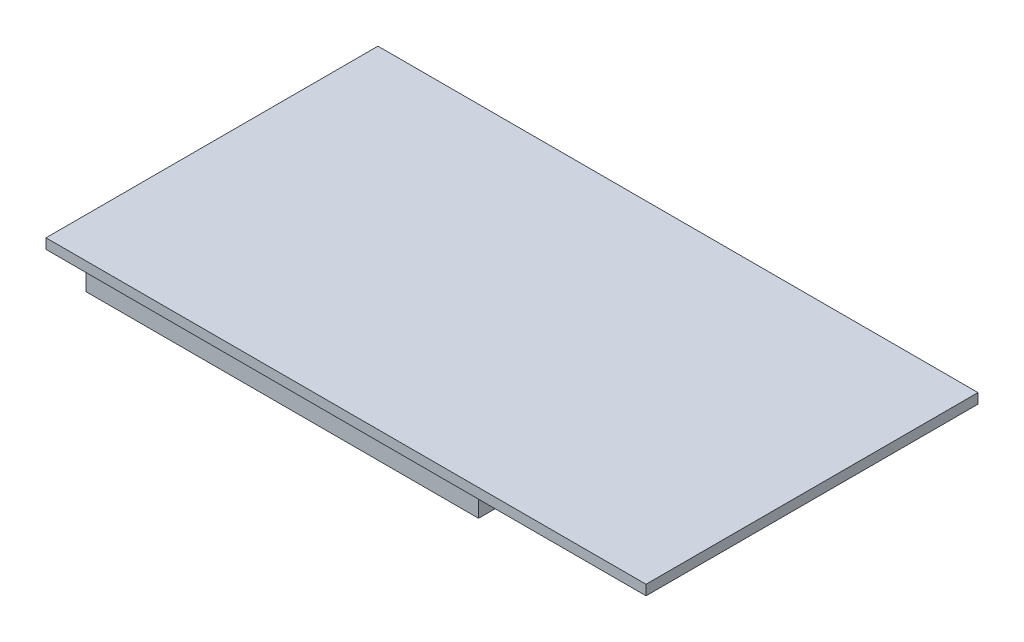
ISO-10303-21;
HEADER;
FILE_DESCRIPTION(('STEP AP214'),'2;1');
FILE_NAME('part.step','',(''),(''),'','','');
FILE_SCHEMA(('AUTOMOTIVE_DESIGN { 1 0 10303 214 1 1 1 1 }'));
ENDSEC;
DATA;
#1=APPLICATION_CONTEXT('core data for automotive mechanical design processes');
#2=APPLICATION_PROTOCOL_DEFINITION('international standard','automotive_design',2000,#1);
#3=PRODUCT_CONTEXT('',#1,'mechanical');
#4=PRODUCT('Part','Part','',(#3));
#5=PRODUCT_RELATED_PRODUCT_CATEGORY('part','',(#4));
#6=PRODUCT_DEFINITION_FORMATION('','',#4);
#7=PRODUCT_DEFINITION_CONTEXT('part definition',#1,'design');
#8=PRODUCT_DEFINITION('design','',#6,#7);
#9=PRODUCT_DEFINITION_SHAPE('','',#8);
#10=(LENGTH_UNIT() NAMED_UNIT(*) SI_UNIT(.MILLI.,.METRE.));
#11=(NAMED_UNIT(*) PLANE_ANGLE_UNIT() SI_UNIT($,.RADIAN.));
#12=(NAMED_UNIT(*) SI_UNIT($,.STERADIAN.) SOLID_ANGLE_UNIT());
#13=UNCERTAINTY_MEASURE_WITH_UNIT(LENGTH_MEASURE(1.E-05),#10,'distance_accuracy_value','');
#14=(GEOMETRIC_REPRESENTATION_CONTEXT(3) GLOBAL_UNCERTAINTY_ASSIGNED_CONTEXT((#13)) GLOBAL_UNIT_ASSIGNED_CONTEXT((#10,
#11,#12)) REPRESENTATION_CONTEXT('',''));
#15=CARTESIAN_POINT('',(0.,0.,0.));
#16=DIRECTION('',(0.,0.,1.));
#17=DIRECTION('',(1.,0.,0.));
#18=AXIS2_PLACEMENT_3D('',#15,#16,#17);
#19=CARTESIAN_POINT('',(0.,0.,0.));
#20=DIRECTION('',(0.,-1.,0.));
#21=DIRECTION('',(0.,0.,-1.));
#22=AXIS2_PLACEMENT_3D('',#19,#20,#21);
#23=PLANE('',#22);
#24=DIRECTION('',(-1.,0.,0.));
#25=VECTOR('',#24,1.);
#26=CARTESIAN_POINT('',(10.,0.,-29.5));
#27=LINE('',#26,#25);
#28=CARTESIAN_POINT('',(10.,0.,-29.5));
#29=VERTEX_POINT('',#28);
#30=CARTESIAN_POINT('',(0.,0.,-29.5));
#31=VERTEX_POINT('',#30);
#32=EDGE_CURVE('E232',#29,#31,#27,.T.);
#33=ORIENTED_EDGE('',*,*,#32,.F.);
#34=DIRECTION('',(0.,0.,-1.));
#35=VECTOR('',#34,1.);
#36=CARTESIAN_POINT('',(10.,0.,-29.5));
#37=LINE('',#36,#35);
#38=CARTESIAN_POINT('',(10.,0.,-36.5));
#39=VERTEX_POINT('',#38);
#40=EDGE_CURVE('E222',#29,#39,#37,.T.);
#41=ORIENTED_EDGE('',*,*,#40,.T.);
#42=DIRECTION('',(-1.,0.,0.));
#43=VECTOR('',#42,1.);
#44=CARTESIAN_POINT('',(10.,0.,-36.5));
#45=LINE('',#44,#43);
#46=CARTESIAN_POINT('',(0.,0.,-36.5));
#47=VERTEX_POINT('',#46);
#48=EDGE_CURVE('E243',#39,#47,#45,.T.);
#49=ORIENTED_EDGE('',*,*,#48,.T.);
#50=DIRECTION('',(0.,0.,1.));
#51=VECTOR('',#50,1.);
#52=CARTESIAN_POINT('',(0.,0.,0.));
#53=LINE('',#52,#51);
#54=CARTESIAN_POINT('',(0.,0.,-66.));
#55=VERTEX_POINT('',#54);
#56=EDGE_CURVE('E314',#55,#47,#53,.T.);
#57=ORIENTED_EDGE('',*,*,#56,.F.);
#58=DIRECTION('',(-1.,0.,0.));
#59=VECTOR('',#58,1.);
#60=CARTESIAN_POINT('',(0.,0.,-66.));
#61=LINE('',#60,#59);
#62=CARTESIAN_POINT('',(119.3,0.,-66.));
#63=VERTEX_POINT('',#62);
#64=EDGE_CURVE('E307',#63,#55,#61,.T.);
#65=ORIENTED_EDGE('',*,*,#64,.F.);
#66=DIRECTION('',(0.,0.,-1.));
#67=VECTOR('',#66,1.);
#68=CARTESIAN_POINT('',(119.3,0.,0.));
#69=LINE('',#68,#67);
#70=CARTESIAN_POINT('',(119.3,0.,0.));
#71=VERTEX_POINT('',#70);
#72=EDGE_CURVE('E319',#71,#63,#69,.T.);
#73=ORIENTED_EDGE('',*,*,#72,.F.);
#74=DIRECTION('',(1.,0.,0.));
#75=VECTOR('',#74,1.);
#76=CARTESIAN_POINT('',(0.,0.,0.));
#77=LINE('',#76,#75);
#78=CARTESIAN_POINT('',(0.,0.,0.));
#79=VERTEX_POINT('',#78);
#80=EDGE_CURVE('E317',#79,#71,#77,.T.);
#81=ORIENTED_EDGE('',*,*,#80,.F.);
#82=EDGE_CURVE('E302',#31,#79,#53,.T.);
#83=ORIENTED_EDGE('',*,*,#82,.F.);
#84=EDGE_LOOP('',(#33,#41,#49,#57,#65,#73,#81,#83));
#85=FACE_BOUND('',#84,.T.);
#86=DIRECTION('',(0.,0.,-1.));
#87=VECTOR('',#86,1.);
#88=CARTESIAN_POINT('',(0.999999999999988,0.,-7.));
#89=LINE('',#88,#87);
#90=CARTESIAN_POINT('',(0.999999999999988,0.,-7.));
#91=VERTEX_POINT('',#90);
#92=CARTESIAN_POINT('',(0.999999999999988,0.,-12.));
#93=VERTEX_POINT('',#92);
#94=EDGE_CURVE('E287',#91,#93,#89,.T.);
#95=ORIENTED_EDGE('',*,*,#94,.F.);
#96=DIRECTION('',(-1.,0.,0.));
#97=VECTOR('',#96,1.);
#98=CARTESIAN_POINT('',(0.999999999999988,0.,-7.));
#99=LINE('',#98,#97);
#100=CARTESIAN_POINT('',(79.,0.,-6.99999999999998));
#101=VERTEX_POINT('',#100);
#102=EDGE_CURVE('E273',#101,#91,#99,.T.);
#103=ORIENTED_EDGE('',*,*,#102,.F.);
#104=DIRECTION('',(0.,0.,1.));
#105=VECTOR('',#104,1.);
#106=CARTESIAN_POINT('',(79.,0.,-6.99999999999998));
#107=LINE('',#106,#105);
#108=CARTESIAN_POINT('',(79.,0.,-12.));
#109=VERTEX_POINT('',#108);
#110=EDGE_CURVE('E278',#109,#101,#107,.T.);
#111=ORIENTED_EDGE('',*,*,#110,.F.);
#112=DIRECTION('',(1.,0.,0.));
#113=VECTOR('',#112,1.);
#114=CARTESIAN_POINT('',(0.999999999999988,0.,-12.));
#115=LINE('',#114,#113);
#116=EDGE_CURVE('E289',#93,#109,#115,.T.);
#117=ORIENTED_EDGE('',*,*,#116,.F.);
#118=EDGE_LOOP('',(#95,#103,#111,#117));
#119=FACE_BOUND('',#118,.T.);
#120=DIRECTION('',(0.,0.,1.));
#121=VECTOR('',#120,1.);
#122=CARTESIAN_POINT('',(79.,0.,-59.));
#123=LINE('',#122,#121);
#124=CARTESIAN_POINT('',(79.,0.,-59.));
#125=VERTEX_POINT('',#124);
#126=CARTESIAN_POINT('',(79.,0.,-54.));
#127=VERTEX_POINT('',#126);
#128=EDGE_CURVE('E260',#125,#127,#123,.T.);
#129=ORIENTED_EDGE('',*,*,#128,.F.);
#130=DIRECTION('',(1.,0.,0.));
#131=VECTOR('',#130,1.);
#132=CARTESIAN_POINT('',(0.999999999999987,0.,-59.));
#133=LINE('',#132,#131);
#134=CARTESIAN_POINT('',(0.999999999999987,0.,-59.));
#135=VERTEX_POINT('',#134);
#136=EDGE_CURVE('E240',#135,#125,#133,.T.);
#137=ORIENTED_EDGE('',*,*,#136,.F.);
#138=DIRECTION('',(0.,0.,-1.));
#139=VECTOR('',#138,1.);
#140=CARTESIAN_POINT('',(0.999999999999987,0.,-59.));
#141=LINE('',#140,#139);
#142=CARTESIAN_POINT('',(0.999999999999988,0.,-54.));
#143=VERTEX_POINT('',#142);
#144=EDGE_CURVE('E251',#143,#135,#141,.T.);
#145=ORIENTED_EDGE('',*,*,#144,.F.);
#146=DIRECTION('',(-1.,0.,0.));
#147=VECTOR('',#146,1.);
#148=CARTESIAN_POINT('',(0.999999999999988,0.,-54.));
#149=LINE('',#148,#147);
#150=EDGE_CURVE('E262',#127,#143,#149,.T.);
#151=ORIENTED_EDGE('',*,*,#150,.F.);
#152=EDGE_LOOP('',(#129,#137,#145,#151));
#153=FACE_BOUND('',#152,.T.);
#154=ADVANCED_FACE('F37',(#85,#119,#153),#23,.T.);
#155=CARTESIAN_POINT('',(0.,2.,0.));
#156=DIRECTION('',(1.,0.,0.));
#157=DIRECTION('',(0.,0.,-1.));
#158=AXIS2_PLACEMENT_3D('',#155,#156,#157);
#159=PLANE('',#158);
#160=ORIENTED_EDGE('',*,*,#56,.T.);
#161=DIRECTION('',(0.,-1.,0.));
#162=VECTOR('',#161,1.);
#163=CARTESIAN_POINT('',(0.,0.,-36.5));
#164=LINE('',#163,#162);
#165=CARTESIAN_POINT('',(0.,-3.,-36.5));
#166=VERTEX_POINT('',#165);
#167=EDGE_CURVE('E234',#47,#166,#164,.T.);
#168=ORIENTED_EDGE('',*,*,#167,.T.);
#169=DIRECTION('',(0.,0.,1.));
#170=VECTOR('',#169,1.);
#171=CARTESIAN_POINT('',(0.,-3.,-29.5));
#172=LINE('',#171,#170);
#173=CARTESIAN_POINT('',(0.,-3.,-29.5));
#174=VERTEX_POINT('',#173);
#175=EDGE_CURVE('E223',#166,#174,#172,.T.);
#176=ORIENTED_EDGE('',*,*,#175,.T.);
#177=DIRECTION('',(0.,1.,0.));
#178=VECTOR('',#177,1.);
#179=CARTESIAN_POINT('',(0.,0.,-29.5));
#180=LINE('',#179,#178);
#181=EDGE_CURVE('E52',#174,#31,#180,.T.);
#182=ORIENTED_EDGE('',*,*,#181,.T.);
#183=ORIENTED_EDGE('',*,*,#82,.T.);
#184=DIRECTION('',(0.,-1.,0.));
#185=VECTOR('',#184,1.);
#186=CARTESIAN_POINT('',(0.,2.,0.));
#187=LINE('',#186,#185);
#188=CARTESIAN_POINT('',(0.,2.,0.));
#189=VERTEX_POINT('',#188);
#190=EDGE_CURVE('E11',#189,#79,#187,.T.);
#191=ORIENTED_EDGE('',*,*,#190,.F.);
#192=DIRECTION('',(0.,0.,1.));
#193=VECTOR('',#192,1.);
#194=CARTESIAN_POINT('',(0.,2.,0.));
#195=LINE('',#194,#193);
#196=CARTESIAN_POINT('',(0.,2.,-66.));
#197=VERTEX_POINT('',#196);
#198=EDGE_CURVE('E303',#197,#189,#195,.T.);
#199=ORIENTED_EDGE('',*,*,#198,.F.);
#200=DIRECTION('',(0.,-1.,0.));
#201=VECTOR('',#200,1.);
#202=CARTESIAN_POINT('',(0.,2.,-66.));
#203=LINE('',#202,#201);
#204=EDGE_CURVE('E313',#197,#55,#203,.T.);
#205=ORIENTED_EDGE('',*,*,#204,.T.);
#206=EDGE_LOOP('',(#160,#168,#176,#182,#183,#191,#199,#205));
#207=FACE_BOUND('',#206,.T.);
#208=DIRECTION('',(0.,0.,1.));
#209=VECTOR('',#208,1.);
#210=CARTESIAN_POINT('',(0.,-2.5,-36.));
#211=LINE('',#210,#209);
#212=CARTESIAN_POINT('',(0.,-2.5,-36.));
#213=VERTEX_POINT('',#212);
#214=CARTESIAN_POINT('',(0.,-2.5,-30.));
#215=VERTEX_POINT('',#214);
#216=EDGE_CURVE('E210',#213,#215,#211,.T.);
#217=ORIENTED_EDGE('',*,*,#216,.F.);
#218=DIRECTION('',(0.,-1.,0.));
#219=VECTOR('',#218,1.);
#220=CARTESIAN_POINT('',(0.,-0.499999999999999,-36.));
#221=LINE('',#220,#219);
#222=CARTESIAN_POINT('',(0.,-0.499999999999999,-36.));
#223=VERTEX_POINT('',#222);
#224=EDGE_CURVE('E183',#223,#213,#221,.T.);
#225=ORIENTED_EDGE('',*,*,#224,.F.);
#226=DIRECTION('',(0.,0.,-1.));
#227=VECTOR('',#226,1.);
#228=CARTESIAN_POINT('',(0.,-0.499999999999999,-36.));
#229=LINE('',#228,#227);
#230=CARTESIAN_POINT('',(0.,-0.499999999999999,-30.));
#231=VERTEX_POINT('',#230);
#232=EDGE_CURVE('E201',#231,#223,#229,.T.);
#233=ORIENTED_EDGE('',*,*,#232,.F.);
#234=DIRECTION('',(0.,1.,0.));
#235=VECTOR('',#234,1.);
#236=CARTESIAN_POINT('',(0.,-0.499999999999999,-30.));
#237=LINE('',#236,#235);
#238=EDGE_CURVE('E204',#215,#231,#237,.T.);
#239=ORIENTED_EDGE('',*,*,#238,.F.);
#240=EDGE_LOOP('',(#217,#225,#233,#239));
#241=FACE_BOUND('',#240,.T.);
#242=ADVANCED_FACE('F39',(#207,#241),#159,.F.);
#243=CARTESIAN_POINT('',(0.,2.,0.));
#244=DIRECTION('',(0.,0.,-1.));
#245=DIRECTION('',(-1.,0.,0.));
#246=AXIS2_PLACEMENT_3D('',#243,#244,#245);
#247=PLANE('',#246);
#248=ORIENTED_EDGE('',*,*,#80,.T.);
#249=DIRECTION('',(0.,-1.,0.));
#250=VECTOR('',#249,1.);
#251=CARTESIAN_POINT('',(119.3,2.,0.));
#252=LINE('',#251,#250);
#253=CARTESIAN_POINT('',(119.3,2.,0.));
#254=VERTEX_POINT('',#253);
#255=EDGE_CURVE('E45',#254,#71,#252,.T.);
#256=ORIENTED_EDGE('',*,*,#255,.F.);
#257=DIRECTION('',(1.,0.,0.));
#258=VECTOR('',#257,1.);
#259=CARTESIAN_POINT('',(0.,2.,0.));
#260=LINE('',#259,#258);
#261=EDGE_CURVE('E306',#189,#254,#260,.T.);
#262=ORIENTED_EDGE('',*,*,#261,.F.);
#263=ORIENTED_EDGE('',*,*,#190,.T.);
#264=EDGE_LOOP('',(#248,#256,#262,#263));
#265=FACE_BOUND('',#264,.T.);
#266=ADVANCED_FACE('F350',(#265),#247,.F.);
#267=CARTESIAN_POINT('',(119.3,2.,0.));
#268=DIRECTION('',(-1.,0.,0.));
#269=DIRECTION('',(0.,0.,1.));
#270=AXIS2_PLACEMENT_3D('',#267,#268,#269);
#271=PLANE('',#270);
#272=ORIENTED_EDGE('',*,*,#72,.T.);
#273=DIRECTION('',(0.,-1.,0.));
#274=VECTOR('',#273,1.);
#275=CARTESIAN_POINT('',(119.3,2.,-66.));
#276=LINE('',#275,#274);
#277=CARTESIAN_POINT('',(119.3,2.,-66.));
#278=VERTEX_POINT('',#277);
#279=EDGE_CURVE('E324',#278,#63,#276,.T.);
#280=ORIENTED_EDGE('',*,*,#279,.F.);
#281=DIRECTION('',(0.,0.,-1.));
#282=VECTOR('',#281,1.);
#283=CARTESIAN_POINT('',(119.3,2.,0.));
#284=LINE('',#283,#282);
#285=EDGE_CURVE('E309',#254,#278,#284,.T.);
#286=ORIENTED_EDGE('',*,*,#285,.F.);
#287=ORIENTED_EDGE('',*,*,#255,.T.);
#288=EDGE_LOOP('',(#272,#280,#286,#287));
#289=FACE_BOUND('',#288,.T.);
#290=ADVANCED_FACE('F331',(#289),#271,.F.);
#291=CARTESIAN_POINT('',(0.,2.,-66.));
#292=DIRECTION('',(0.,0.,1.));
#293=DIRECTION('',(1.,0.,0.));
#294=AXIS2_PLACEMENT_3D('',#291,#292,#293);
#295=PLANE('',#294);
#296=ORIENTED_EDGE('',*,*,#64,.T.);
#297=ORIENTED_EDGE('',*,*,#204,.F.);
#298=DIRECTION('',(-1.,0.,0.));
#299=VECTOR('',#298,1.);
#300=CARTESIAN_POINT('',(0.,2.,-66.));
#301=LINE('',#300,#299);
#302=EDGE_CURVE('E311',#278,#197,#301,.T.);
#303=ORIENTED_EDGE('',*,*,#302,.F.);
#304=ORIENTED_EDGE('',*,*,#279,.T.);
#305=EDGE_LOOP('',(#296,#297,#303,#304));
#306=FACE_BOUND('',#305,.T.);
#307=ADVANCED_FACE('F343',(#306),#295,.F.);
#308=CARTESIAN_POINT('',(0.,2.,0.));
#309=DIRECTION('',(0.,-1.,0.));
#310=DIRECTION('',(0.,0.,-1.));
#311=AXIS2_PLACEMENT_3D('',#308,#309,#310);
#312=PLANE('',#311);
#313=ORIENTED_EDGE('',*,*,#198,.T.);
#314=ORIENTED_EDGE('',*,*,#261,.T.);
#315=ORIENTED_EDGE('',*,*,#285,.T.);
#316=ORIENTED_EDGE('',*,*,#302,.T.);
#317=EDGE_LOOP('',(#313,#314,#315,#316));
#318=FACE_BOUND('',#317,.T.);
#319=ADVANCED_FACE('F349',(#318),#312,.F.);
#320=CARTESIAN_POINT('',(0.999999999999988,-10.3,-7.));
#321=DIRECTION('',(0.,0.,-1.));
#322=DIRECTION('',(-1.,0.,0.));
#323=AXIS2_PLACEMENT_3D('',#320,#321,#322);
#324=PLANE('',#323);
#325=ORIENTED_EDGE('',*,*,#102,.T.);
#326=DIRECTION('',(0.,1.,0.));
#327=VECTOR('',#326,1.);
#328=CARTESIAN_POINT('',(0.999999999999988,-10.3,-7.));
#329=LINE('',#328,#327);
#330=CARTESIAN_POINT('',(0.999999999999988,-10.3,-7.));
#331=VERTEX_POINT('',#330);
#332=EDGE_CURVE('E300',#331,#91,#329,.T.);
#333=ORIENTED_EDGE('',*,*,#332,.F.);
#334=DIRECTION('',(-1.,0.,0.));
#335=VECTOR('',#334,1.);
#336=CARTESIAN_POINT('',(0.999999999999988,-10.3,-7.));
#337=LINE('',#336,#335);
#338=CARTESIAN_POINT('',(79.,-10.3,-6.99999999999998));
#339=VERTEX_POINT('',#338);
#340=EDGE_CURVE('E274',#339,#331,#337,.T.);
#341=ORIENTED_EDGE('',*,*,#340,.F.);
#342=DIRECTION('',(0.,1.,0.));
#343=VECTOR('',#342,1.);
#344=CARTESIAN_POINT('',(79.,-10.3,-6.99999999999998));
#345=LINE('',#344,#343);
#346=EDGE_CURVE('E284',#339,#101,#345,.T.);
#347=ORIENTED_EDGE('',*,*,#346,.T.);
#348=EDGE_LOOP('',(#325,#333,#341,#347));
#349=FACE_BOUND('',#348,.T.);
#350=ADVANCED_FACE('F368',(#349),#324,.F.);
#351=CARTESIAN_POINT('',(0.999999999999988,-10.3,-7.));
#352=DIRECTION('',(1.,0.,0.));
#353=DIRECTION('',(0.,0.,-1.));
#354=AXIS2_PLACEMENT_3D('',#351,#352,#353);
#355=PLANE('',#354);
#356=ORIENTED_EDGE('',*,*,#94,.T.);
#357=DIRECTION('',(0.,1.,0.));
#358=VECTOR('',#357,1.);
#359=CARTESIAN_POINT('',(0.999999999999988,-10.3,-12.));
#360=LINE('',#359,#358);
#361=CARTESIAN_POINT('',(0.999999999999988,-10.3,-12.));
#362=VERTEX_POINT('',#361);
#363=EDGE_CURVE('E297',#362,#93,#360,.T.);
#364=ORIENTED_EDGE('',*,*,#363,.F.);
#365=DIRECTION('',(0.,0.,-1.));
#366=VECTOR('',#365,1.);
#367=CARTESIAN_POINT('',(0.999999999999988,-10.3,-7.));
#368=LINE('',#367,#366);
#369=EDGE_CURVE('E277',#331,#362,#368,.T.);
#370=ORIENTED_EDGE('',*,*,#369,.F.);
#371=ORIENTED_EDGE('',*,*,#332,.T.);
#372=EDGE_LOOP('',(#356,#364,#370,#371));
#373=FACE_BOUND('',#372,.T.);
#374=ADVANCED_FACE('F372',(#373),#355,.F.);
#375=CARTESIAN_POINT('',(0.999999999999988,-10.3,-12.));
#376=DIRECTION('',(0.,0.,1.));
#377=DIRECTION('',(1.,0.,0.));
#378=AXIS2_PLACEMENT_3D('',#375,#376,#377);
#379=PLANE('',#378);
#380=ORIENTED_EDGE('',*,*,#116,.T.);
#381=DIRECTION('',(0.,1.,0.));
#382=VECTOR('',#381,1.);
#383=CARTESIAN_POINT('',(79.,-10.3,-12.));
#384=LINE('',#383,#382);
#385=CARTESIAN_POINT('',(79.,-10.3,-12.));
#386=VERTEX_POINT('',#385);
#387=EDGE_CURVE('E295',#386,#109,#384,.T.);
#388=ORIENTED_EDGE('',*,*,#387,.F.);
#389=DIRECTION('',(1.,0.,0.));
#390=VECTOR('',#389,1.);
#391=CARTESIAN_POINT('',(0.999999999999988,-10.3,-12.));
#392=LINE('',#391,#390);
#393=EDGE_CURVE('E280',#362,#386,#392,.T.);
#394=ORIENTED_EDGE('',*,*,#393,.F.);
#395=ORIENTED_EDGE('',*,*,#363,.T.);
#396=EDGE_LOOP('',(#380,#388,#394,#395));
#397=FACE_BOUND('',#396,.T.);
#398=ADVANCED_FACE('F377',(#397),#379,.F.);
#399=CARTESIAN_POINT('',(79.,-10.3,-6.99999999999998));
#400=DIRECTION('',(-1.,0.,0.));
#401=DIRECTION('',(0.,0.,1.));
#402=AXIS2_PLACEMENT_3D('',#399,#400,#401);
#403=PLANE('',#402);
#404=ORIENTED_EDGE('',*,*,#110,.T.);
#405=ORIENTED_EDGE('',*,*,#346,.F.);
#406=DIRECTION('',(0.,0.,1.));
#407=VECTOR('',#406,1.);
#408=CARTESIAN_POINT('',(79.,-10.3,-6.99999999999998));
#409=LINE('',#408,#407);
#410=EDGE_CURVE('E282',#386,#339,#409,.T.);
#411=ORIENTED_EDGE('',*,*,#410,.F.);
#412=ORIENTED_EDGE('',*,*,#387,.T.);
#413=EDGE_LOOP('',(#404,#405,#411,#412));
#414=FACE_BOUND('',#413,.T.);
#415=ADVANCED_FACE('F383',(#414),#403,.F.);
#416=CARTESIAN_POINT('',(0.,-10.3,0.));
#417=DIRECTION('',(0.,1.,0.));
#418=DIRECTION('',(0.,0.,1.));
#419=AXIS2_PLACEMENT_3D('',#416,#417,#418);
#420=PLANE('',#419);
#421=ORIENTED_EDGE('',*,*,#340,.T.);
#422=ORIENTED_EDGE('',*,*,#369,.T.);
#423=ORIENTED_EDGE('',*,*,#393,.T.);
#424=ORIENTED_EDGE('',*,*,#410,.T.);
#425=EDGE_LOOP('',(#421,#422,#423,#424));
#426=FACE_BOUND('',#425,.T.);
#427=ADVANCED_FACE('F387',(#426),#420,.F.);
#428=CARTESIAN_POINT('',(0.999999999999987,-10.3,-59.));
#429=DIRECTION('',(0.,0.,1.));
#430=DIRECTION('',(1.,0.,0.));
#431=AXIS2_PLACEMENT_3D('',#428,#429,#430);
#432=PLANE('',#431);
#433=ORIENTED_EDGE('',*,*,#136,.T.);
#434=DIRECTION('',(0.,1.,0.));
#435=VECTOR('',#434,1.);
#436=CARTESIAN_POINT('',(79.,-10.3,-59.));
#437=LINE('',#436,#435);
#438=CARTESIAN_POINT('',(79.,-10.3,-59.));
#439=VERTEX_POINT('',#438);
#440=EDGE_CURVE('E271',#439,#125,#437,.T.);
#441=ORIENTED_EDGE('',*,*,#440,.F.);
#442=DIRECTION('',(1.,0.,0.));
#443=VECTOR('',#442,1.);
#444=CARTESIAN_POINT('',(0.999999999999987,-10.3,-59.));
#445=LINE('',#444,#443);
#446=CARTESIAN_POINT('',(0.999999999999987,-10.3,-59.));
#447=VERTEX_POINT('',#446);
#448=EDGE_CURVE('E247',#447,#439,#445,.T.);
#449=ORIENTED_EDGE('',*,*,#448,.F.);
#450=DIRECTION('',(0.,1.,0.));
#451=VECTOR('',#450,1.);
#452=CARTESIAN_POINT('',(0.999999999999987,-10.3,-59.));
#453=LINE('',#452,#451);
#454=EDGE_CURVE('E257',#447,#135,#453,.T.);
#455=ORIENTED_EDGE('',*,*,#454,.T.);
#456=EDGE_LOOP('',(#433,#441,#449,#455));
#457=FACE_BOUND('',#456,.T.);
#458=ADVANCED_FACE('F391',(#457),#432,.F.);
#459=CARTESIAN_POINT('',(79.,-10.3,-59.));
#460=DIRECTION('',(-1.,0.,0.));
#461=DIRECTION('',(0.,0.,1.));
#462=AXIS2_PLACEMENT_3D('',#459,#460,#461);
#463=PLANE('',#462);
#464=ORIENTED_EDGE('',*,*,#128,.T.);
#465=DIRECTION('',(0.,1.,0.));
#466=VECTOR('',#465,1.);
#467=CARTESIAN_POINT('',(79.,-10.3,-54.));
#468=LINE('',#467,#466);
#469=CARTESIAN_POINT('',(79.,-10.3,-54.));
#470=VERTEX_POINT('',#469);
#471=EDGE_CURVE('E268',#470,#127,#468,.T.);
#472=ORIENTED_EDGE('',*,*,#471,.F.);
#473=DIRECTION('',(0.,0.,1.));
#474=VECTOR('',#473,1.);
#475=CARTESIAN_POINT('',(79.,-10.3,-59.));
#476=LINE('',#475,#474);
#477=EDGE_CURVE('E250',#439,#470,#476,.T.);
#478=ORIENTED_EDGE('',*,*,#477,.F.);
#479=ORIENTED_EDGE('',*,*,#440,.T.);
#480=EDGE_LOOP('',(#464,#472,#478,#479));
#481=FACE_BOUND('',#480,.T.);
#482=ADVANCED_FACE('F395',(#481),#463,.F.);
#483=CARTESIAN_POINT('',(0.999999999999988,-10.3,-54.));
#484=DIRECTION('',(0.,0.,-1.));
#485=DIRECTION('',(-1.,0.,0.));
#486=AXIS2_PLACEMENT_3D('',#483,#484,#485);
#487=PLANE('',#486);
#488=ORIENTED_EDGE('',*,*,#150,.T.);
#489=DIRECTION('',(0.,1.,0.));
#490=VECTOR('',#489,1.);
#491=CARTESIAN_POINT('',(0.999999999999988,-10.3,-54.));
#492=LINE('',#491,#490);
#493=CARTESIAN_POINT('',(0.999999999999988,-10.3,-54.));
#494=VERTEX_POINT('',#493);
#495=EDGE_CURVE('E60',#494,#143,#492,.T.);
#496=ORIENTED_EDGE('',*,*,#495,.F.);
#497=DIRECTION('',(-1.,0.,0.));
#498=VECTOR('',#497,1.);
#499=CARTESIAN_POINT('',(0.999999999999988,-10.3,-54.));
#500=LINE('',#499,#498);
#501=EDGE_CURVE('E253',#470,#494,#500,.T.);
#502=ORIENTED_EDGE('',*,*,#501,.F.);
#503=ORIENTED_EDGE('',*,*,#471,.T.);
#504=EDGE_LOOP('',(#488,#496,#502,#503));
#505=FACE_BOUND('',#504,.T.);
#506=ADVANCED_FACE('F399',(#505),#487,.F.);
#507=CARTESIAN_POINT('',(0.999999999999987,-10.3,-59.));
#508=DIRECTION('',(1.,0.,0.));
#509=DIRECTION('',(0.,0.,-1.));
#510=AXIS2_PLACEMENT_3D('',#507,#508,#509);
#511=PLANE('',#510);
#512=ORIENTED_EDGE('',*,*,#144,.T.);
#513=ORIENTED_EDGE('',*,*,#454,.F.);
#514=DIRECTION('',(0.,0.,-1.));
#515=VECTOR('',#514,1.);
#516=CARTESIAN_POINT('',(0.999999999999987,-10.3,-59.));
#517=LINE('',#516,#515);
#518=EDGE_CURVE('E255',#494,#447,#517,.T.);
#519=ORIENTED_EDGE('',*,*,#518,.F.);
#520=ORIENTED_EDGE('',*,*,#495,.T.);
#521=EDGE_LOOP('',(#512,#513,#519,#520));
#522=FACE_BOUND('',#521,.T.);
#523=ADVANCED_FACE('F403',(#522),#511,.F.);
#524=CARTESIAN_POINT('',(0.,-10.3,0.));
#525=DIRECTION('',(0.,-1.,0.));
#526=DIRECTION('',(0.,0.,-1.));
#527=AXIS2_PLACEMENT_3D('',#524,#525,#526);
#528=PLANE('',#527);
#529=ORIENTED_EDGE('',*,*,#448,.T.);
#530=ORIENTED_EDGE('',*,*,#477,.T.);
#531=ORIENTED_EDGE('',*,*,#501,.T.);
#532=ORIENTED_EDGE('',*,*,#518,.T.);
#533=EDGE_LOOP('',(#529,#530,#531,#532));
#534=FACE_BOUND('',#533,.T.);
#535=ADVANCED_FACE('F407',(#534),#528,.T.);
#536=CARTESIAN_POINT('',(10.,0.,-29.5));
#537=DIRECTION('',(0.,0.,1.));
#538=DIRECTION('',(1.,0.,0.));
#539=AXIS2_PLACEMENT_3D('',#536,#537,#538);
#540=PLANE('',#539);
#541=ORIENTED_EDGE('',*,*,#181,.F.);
#542=DIRECTION('',(-1.,0.,0.));
#543=VECTOR('',#542,1.);
#544=CARTESIAN_POINT('',(10.,-3.,-29.5));
#545=LINE('',#544,#543);
#546=CARTESIAN_POINT('',(10.,-3.,-29.5));
#547=VERTEX_POINT('',#546);
#548=EDGE_CURVE('E238',#547,#174,#545,.T.);
#549=ORIENTED_EDGE('',*,*,#548,.F.);
#550=DIRECTION('',(0.,1.,0.));
#551=VECTOR('',#550,1.);
#552=CARTESIAN_POINT('',(10.,0.,-29.5));
#553=LINE('',#552,#551);
#554=EDGE_CURVE('E219',#547,#29,#553,.T.);
#555=ORIENTED_EDGE('',*,*,#554,.T.);
#556=ORIENTED_EDGE('',*,*,#32,.T.);
#557=EDGE_LOOP('',(#541,#549,#555,#556));
#558=FACE_BOUND('',#557,.T.);
#559=ADVANCED_FACE('F410',(#558),#540,.T.);
#560=CARTESIAN_POINT('',(10.,-3.,-29.5));
#561=DIRECTION('',(0.,-1.,0.));
#562=DIRECTION('',(0.,0.,-1.));
#563=AXIS2_PLACEMENT_3D('',#560,#561,#562);
#564=PLANE('',#563);
#565=ORIENTED_EDGE('',*,*,#175,.F.);
#566=DIRECTION('',(-1.,0.,0.));
#567=VECTOR('',#566,1.);
#568=CARTESIAN_POINT('',(10.,-3.,-36.5));
#569=LINE('',#568,#567);
#570=CARTESIAN_POINT('',(10.,-3.,-36.5));
#571=VERTEX_POINT('',#570);
#572=EDGE_CURVE('E241',#571,#166,#569,.T.);
#573=ORIENTED_EDGE('',*,*,#572,.F.);
#574=DIRECTION('',(0.,0.,1.));
#575=VECTOR('',#574,1.);
#576=CARTESIAN_POINT('',(10.,-3.,-29.5));
#577=LINE('',#576,#575);
#578=EDGE_CURVE('E229',#571,#547,#577,.T.);
#579=ORIENTED_EDGE('',*,*,#578,.T.);
#580=ORIENTED_EDGE('',*,*,#548,.T.);
#581=EDGE_LOOP('',(#565,#573,#579,#580));
#582=FACE_BOUND('',#581,.T.);
#583=ADVANCED_FACE('F414',(#582),#564,.T.);
#584=CARTESIAN_POINT('',(10.,0.,-36.5));
#585=DIRECTION('',(0.,0.,-1.));
#586=DIRECTION('',(-1.,0.,0.));
#587=AXIS2_PLACEMENT_3D('',#584,#585,#586);
#588=PLANE('',#587);
#589=ORIENTED_EDGE('',*,*,#167,.F.);
#590=ORIENTED_EDGE('',*,*,#48,.F.);
#591=DIRECTION('',(0.,-1.,0.));
#592=VECTOR('',#591,1.);
#593=CARTESIAN_POINT('',(10.,0.,-36.5));
#594=LINE('',#593,#592);
#595=EDGE_CURVE('E226',#39,#571,#594,.T.);
#596=ORIENTED_EDGE('',*,*,#595,.T.);
#597=ORIENTED_EDGE('',*,*,#572,.T.);
#598=EDGE_LOOP('',(#589,#590,#596,#597));
#599=FACE_BOUND('',#598,.T.);
#600=ADVANCED_FACE('F416',(#599),#588,.T.);
#601=CARTESIAN_POINT('',(10.,0.,0.));
#602=DIRECTION('',(1.,0.,0.));
#603=DIRECTION('',(0.,0.,-1.));
#604=AXIS2_PLACEMENT_3D('',#601,#602,#603);
#605=PLANE('',#604);
#606=DIRECTION('',(0.,-1.,0.));
#607=VECTOR('',#606,1.);
#608=CARTESIAN_POINT('',(10.,-0.499999999999999,-36.));
#609=LINE('',#608,#607);
#610=CARTESIAN_POINT('',(10.,-0.499999999999999,-36.));
#611=VERTEX_POINT('',#610);
#612=CARTESIAN_POINT('',(10.,-2.5,-36.));
#613=VERTEX_POINT('',#612);
#614=EDGE_CURVE('E180',#611,#613,#609,.T.);
#615=ORIENTED_EDGE('',*,*,#614,.T.);
#616=DIRECTION('',(0.,0.,1.));
#617=VECTOR('',#616,1.);
#618=CARTESIAN_POINT('',(10.,-2.5,-36.));
#619=LINE('',#618,#617);
#620=CARTESIAN_POINT('',(10.,-2.5,-30.));
#621=VERTEX_POINT('',#620);
#622=EDGE_CURVE('E192',#613,#621,#619,.T.);
#623=ORIENTED_EDGE('',*,*,#622,.T.);
#624=DIRECTION('',(0.,1.,0.));
#625=VECTOR('',#624,1.);
#626=CARTESIAN_POINT('',(10.,-0.499999999999999,-30.));
#627=LINE('',#626,#625);
#628=CARTESIAN_POINT('',(10.,-0.499999999999999,-30.));
#629=VERTEX_POINT('',#628);
#630=EDGE_CURVE('E196',#621,#629,#627,.T.);
#631=ORIENTED_EDGE('',*,*,#630,.T.);
#632=DIRECTION('',(0.,0.,-1.));
#633=VECTOR('',#632,1.);
#634=CARTESIAN_POINT('',(10.,-0.499999999999999,-36.));
#635=LINE('',#634,#633);
#636=EDGE_CURVE('E188',#629,#611,#635,.T.);
#637=ORIENTED_EDGE('',*,*,#636,.T.);
#638=EDGE_LOOP('',(#615,#623,#631,#637));
#639=FACE_BOUND('',#638,.T.);
#640=ORIENTED_EDGE('',*,*,#554,.F.);
#641=ORIENTED_EDGE('',*,*,#578,.F.);
#642=ORIENTED_EDGE('',*,*,#595,.F.);
#643=ORIENTED_EDGE('',*,*,#40,.F.);
#644=EDGE_LOOP('',(#640,#641,#642,#643));
#645=FACE_BOUND('',#644,.T.);
#646=ADVANCED_FACE('F198',(#639,#645),#605,.T.);
#647=CARTESIAN_POINT('',(10.,-0.499999999999999,-36.));
#648=DIRECTION('',(0.,0.,-1.));
#649=DIRECTION('',(-1.,0.,0.));
#650=AXIS2_PLACEMENT_3D('',#647,#648,#649);
#651=PLANE('',#650);
#652=ORIENTED_EDGE('',*,*,#224,.T.);
#653=DIRECTION('',(-1.,0.,0.));
#654=VECTOR('',#653,1.);
#655=CARTESIAN_POINT('',(10.,-2.5,-36.));
#656=LINE('',#655,#654);
#657=EDGE_CURVE('E176',#613,#213,#656,.T.);
#658=ORIENTED_EDGE('',*,*,#657,.F.);
#659=ORIENTED_EDGE('',*,*,#614,.F.);
#660=DIRECTION('',(-1.,0.,0.));
#661=VECTOR('',#660,1.);
#662=CARTESIAN_POINT('',(10.,-0.499999999999999,-36.));
#663=LINE('',#662,#661);
#664=EDGE_CURVE('E214',#611,#223,#663,.T.);
#665=ORIENTED_EDGE('',*,*,#664,.T.);
#666=EDGE_LOOP('',(#652,#658,#659,#665));
#667=FACE_BOUND('',#666,.T.);
#668=ADVANCED_FACE('F178',(#667),#651,.F.);
#669=CARTESIAN_POINT('',(10.,-0.499999999999999,-36.));
#670=DIRECTION('',(0.,1.,0.));
#671=DIRECTION('',(0.,0.,1.));
#672=AXIS2_PLACEMENT_3D('',#669,#670,#671);
#673=PLANE('',#672);
#674=ORIENTED_EDGE('',*,*,#232,.T.);
#675=ORIENTED_EDGE('',*,*,#664,.F.);
#676=ORIENTED_EDGE('',*,*,#636,.F.);
#677=DIRECTION('',(-1.,0.,0.));
#678=VECTOR('',#677,1.);
#679=CARTESIAN_POINT('',(10.,-0.499999999999999,-30.));
#680=LINE('',#679,#678);
#681=EDGE_CURVE('E216',#629,#231,#680,.T.);
#682=ORIENTED_EDGE('',*,*,#681,.T.);
#683=EDGE_LOOP('',(#674,#675,#676,#682));
#684=FACE_BOUND('',#683,.T.);
#685=ADVANCED_FACE('F427',(#684),#673,.F.);
#686=CARTESIAN_POINT('',(10.,-0.499999999999999,-30.));
#687=DIRECTION('',(0.,0.,1.));
#688=DIRECTION('',(1.,0.,0.));
#689=AXIS2_PLACEMENT_3D('',#686,#687,#688);
#690=PLANE('',#689);
#691=ORIENTED_EDGE('',*,*,#238,.T.);
#692=ORIENTED_EDGE('',*,*,#681,.F.);
#693=ORIENTED_EDGE('',*,*,#630,.F.);
#694=DIRECTION('',(-1.,0.,0.));
#695=VECTOR('',#694,1.);
#696=CARTESIAN_POINT('',(10.,-2.5,-30.));
#697=LINE('',#696,#695);
#698=EDGE_CURVE('E187',#621,#215,#697,.T.);
#699=ORIENTED_EDGE('',*,*,#698,.T.);
#700=EDGE_LOOP('',(#691,#692,#693,#699));
#701=FACE_BOUND('',#700,.T.);
#702=ADVANCED_FACE('F430',(#701),#690,.F.);
#703=CARTESIAN_POINT('',(10.,-2.5,-36.));
#704=DIRECTION('',(0.,-1.,0.));
#705=DIRECTION('',(0.,0.,-1.));
#706=AXIS2_PLACEMENT_3D('',#703,#704,#705);
#707=PLANE('',#706);
#708=ORIENTED_EDGE('',*,*,#216,.T.);
#709=ORIENTED_EDGE('',*,*,#698,.F.);
#710=ORIENTED_EDGE('',*,*,#622,.F.);
#711=ORIENTED_EDGE('',*,*,#657,.T.);
#712=EDGE_LOOP('',(#708,#709,#710,#711));
#713=FACE_BOUND('',#712,.T.);
#714=ADVANCED_FACE('F193',(#713),#707,.F.);
#715=CLOSED_SHELL('',(#154,#242,#266,#290,#307,#319,#350,#374,#398,#415,#427,#458,#482,#506,
#523,#535,#559,#583,#600,#646,#668,#685,#702,#714));
#716=MANIFOLD_SOLID_BREP('B2',#715);
#717=ADVANCED_BREP_SHAPE_REPRESENTATION('',(#18,#716),#14);
#718=SHAPE_DEFINITION_REPRESENTATION(#9,#717);
ENDSEC;
END-ISO-10303-21;
